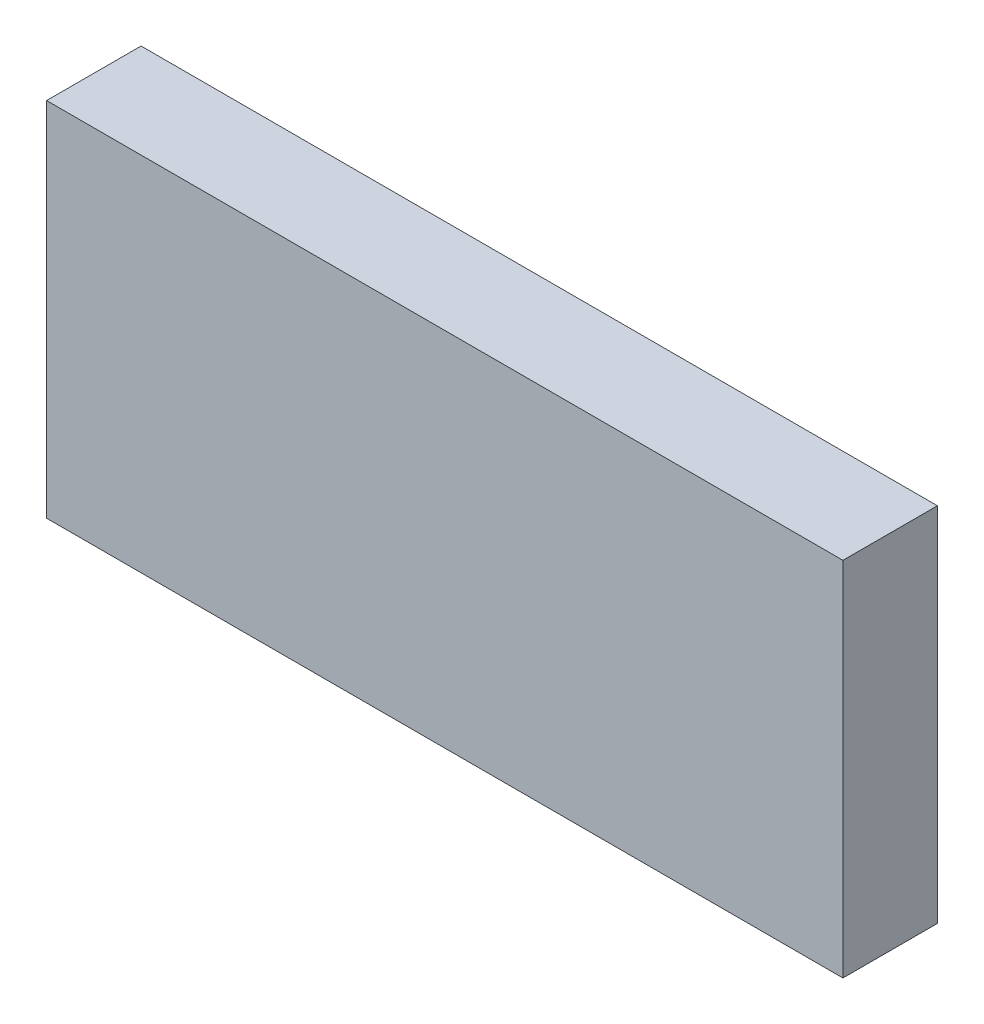
ISO-10303-21;
HEADER;
FILE_DESCRIPTION(('STEP AP214'),'2;1');
FILE_NAME('part.step','',(''),(''),'','','');
FILE_SCHEMA(('AUTOMOTIVE_DESIGN { 1 0 10303 214 1 1 1 1 }'));
ENDSEC;
DATA;
#1=APPLICATION_CONTEXT('core data for automotive mechanical design processes');
#2=APPLICATION_PROTOCOL_DEFINITION('international standard','automotive_design',2000,#1);
#3=PRODUCT_CONTEXT('',#1,'mechanical');
#4=PRODUCT('Part','Part','',(#3));
#5=PRODUCT_RELATED_PRODUCT_CATEGORY('part','',(#4));
#6=PRODUCT_DEFINITION_FORMATION('','',#4);
#7=PRODUCT_DEFINITION_CONTEXT('part definition',#1,'design');
#8=PRODUCT_DEFINITION('design','',#6,#7);
#9=PRODUCT_DEFINITION_SHAPE('','',#8);
#10=(LENGTH_UNIT() NAMED_UNIT(*) SI_UNIT(.MILLI.,.METRE.));
#11=(NAMED_UNIT(*) PLANE_ANGLE_UNIT() SI_UNIT($,.RADIAN.));
#12=(NAMED_UNIT(*) SI_UNIT($,.STERADIAN.) SOLID_ANGLE_UNIT());
#13=UNCERTAINTY_MEASURE_WITH_UNIT(LENGTH_MEASURE(1.E-05),#10,'distance_accuracy_value','');
#14=(GEOMETRIC_REPRESENTATION_CONTEXT(3) GLOBAL_UNCERTAINTY_ASSIGNED_CONTEXT((#13)) GLOBAL_UNIT_ASSIGNED_CONTEXT((#10,
#11,#12)) REPRESENTATION_CONTEXT('',''));
#15=CARTESIAN_POINT('',(0.,0.,0.));
#16=DIRECTION('',(0.,0.,1.));
#17=DIRECTION('',(1.,0.,0.));
#18=AXIS2_PLACEMENT_3D('',#15,#16,#17);
#19=CARTESIAN_POINT('',(0.,38.2926221353073,10.));
#20=DIRECTION('',(1.,0.,0.));
#21=DIRECTION('',(0.,0.,-1.));
#22=AXIS2_PLACEMENT_3D('',#19,#20,#21);
#23=PLANE('',#22);
#24=DIRECTION('',(0.,-1.,0.));
#25=VECTOR('',#24,1.);
#26=CARTESIAN_POINT('',(0.,38.2926221353073,0.));
#27=LINE('',#26,#25);
#28=CARTESIAN_POINT('',(0.,38.2926221353073,0.));
#29=VERTEX_POINT('',#28);
#30=CARTESIAN_POINT('',(0.,0.,0.));
#31=VERTEX_POINT('',#30);
#32=EDGE_CURVE('E113',#29,#31,#27,.T.);
#33=ORIENTED_EDGE('',*,*,#32,.T.);
#34=DIRECTION('',(0.,0.,-1.));
#35=VECTOR('',#34,1.);
#36=CARTESIAN_POINT('',(0.,0.,10.));
#37=LINE('',#36,#35);
#38=CARTESIAN_POINT('',(0.,0.,10.));
#39=VERTEX_POINT('',#38);
#40=EDGE_CURVE('E11',#39,#31,#37,.T.);
#41=ORIENTED_EDGE('',*,*,#40,.F.);
#42=DIRECTION('',(0.,-1.,0.));
#43=VECTOR('',#42,1.);
#44=CARTESIAN_POINT('',(0.,38.2926221353073,10.));
#45=LINE('',#44,#43);
#46=CARTESIAN_POINT('',(0.,38.2926221353073,10.));
#47=VERTEX_POINT('',#46);
#48=EDGE_CURVE('E97',#47,#39,#45,.T.);
#49=ORIENTED_EDGE('',*,*,#48,.F.);
#50=DIRECTION('',(0.,0.,-1.));
#51=VECTOR('',#50,1.);
#52=CARTESIAN_POINT('',(0.,38.2926221353073,10.));
#53=LINE('',#52,#51);
#54=EDGE_CURVE('E109',#47,#29,#53,.T.);
#55=ORIENTED_EDGE('',*,*,#54,.T.);
#56=EDGE_LOOP('',(#33,#41,#49,#55));
#57=FACE_BOUND('',#56,.T.);
#58=ADVANCED_FACE('F45',(#57),#23,.F.);
#59=CARTESIAN_POINT('',(0.,0.,10.));
#60=DIRECTION('',(0.,1.,0.));
#61=DIRECTION('',(0.,0.,1.));
#62=AXIS2_PLACEMENT_3D('',#59,#60,#61);
#63=PLANE('',#62);
#64=DIRECTION('',(1.,0.,0.));
#65=VECTOR('',#64,1.);
#66=CARTESIAN_POINT('',(0.,0.,0.));
#67=LINE('',#66,#65);
#68=CARTESIAN_POINT('',(84.2976702989358,0.,0.));
#69=VERTEX_POINT('',#68);
#70=EDGE_CURVE('E102',#31,#69,#67,.T.);
#71=ORIENTED_EDGE('',*,*,#70,.T.);
#72=DIRECTION('',(0.,0.,-1.));
#73=VECTOR('',#72,1.);
#74=CARTESIAN_POINT('',(84.2976702989358,0.,10.));
#75=LINE('',#74,#73);
#76=CARTESIAN_POINT('',(84.2976702989358,0.,10.));
#77=VERTEX_POINT('',#76);
#78=EDGE_CURVE('E54',#77,#69,#75,.T.);
#79=ORIENTED_EDGE('',*,*,#78,.F.);
#80=DIRECTION('',(1.,0.,0.));
#81=VECTOR('',#80,1.);
#82=CARTESIAN_POINT('',(0.,0.,10.));
#83=LINE('',#82,#81);
#84=EDGE_CURVE('E92',#39,#77,#83,.T.);
#85=ORIENTED_EDGE('',*,*,#84,.F.);
#86=ORIENTED_EDGE('',*,*,#40,.T.);
#87=EDGE_LOOP('',(#71,#79,#85,#86));
#88=FACE_BOUND('',#87,.T.);
#89=ADVANCED_FACE('F101',(#88),#63,.F.);
#90=CARTESIAN_POINT('',(84.2976702989358,0.,10.));
#91=DIRECTION('',(-1.,0.,0.));
#92=DIRECTION('',(0.,0.,1.));
#93=AXIS2_PLACEMENT_3D('',#90,#91,#92);
#94=PLANE('',#93);
#95=DIRECTION('',(0.,1.,0.));
#96=VECTOR('',#95,1.);
#97=CARTESIAN_POINT('',(84.2976702989358,0.,0.));
#98=LINE('',#97,#96);
#99=CARTESIAN_POINT('',(84.2976702989358,38.2926221353073,0.));
#100=VERTEX_POINT('',#99);
#101=EDGE_CURVE('E79',#69,#100,#98,.T.);
#102=ORIENTED_EDGE('',*,*,#101,.T.);
#103=DIRECTION('',(0.,0.,-1.));
#104=VECTOR('',#103,1.);
#105=CARTESIAN_POINT('',(84.2976702989358,38.2926221353073,10.));
#106=LINE('',#105,#104);
#107=CARTESIAN_POINT('',(84.2976702989358,38.2926221353073,10.));
#108=VERTEX_POINT('',#107);
#109=EDGE_CURVE('E104',#108,#100,#106,.T.);
#110=ORIENTED_EDGE('',*,*,#109,.F.);
#111=DIRECTION('',(0.,1.,0.));
#112=VECTOR('',#111,1.);
#113=CARTESIAN_POINT('',(84.2976702989358,0.,10.));
#114=LINE('',#113,#112);
#115=EDGE_CURVE('E95',#77,#108,#114,.T.);
#116=ORIENTED_EDGE('',*,*,#115,.F.);
#117=ORIENTED_EDGE('',*,*,#78,.T.);
#118=EDGE_LOOP('',(#102,#110,#116,#117));
#119=FACE_BOUND('',#118,.T.);
#120=ADVANCED_FACE('F105',(#119),#94,.F.);
#121=CARTESIAN_POINT('',(84.2976702989358,38.2926221353073,10.));
#122=DIRECTION('',(0.,-1.,0.));
#123=DIRECTION('',(0.,0.,-1.));
#124=AXIS2_PLACEMENT_3D('',#121,#122,#123);
#125=PLANE('',#124);
#126=DIRECTION('',(-1.,0.,0.));
#127=VECTOR('',#126,1.);
#128=CARTESIAN_POINT('',(84.2976702989358,38.2926221353073,0.));
#129=LINE('',#128,#127);
#130=EDGE_CURVE('E85',#100,#29,#129,.T.);
#131=ORIENTED_EDGE('',*,*,#130,.T.);
#132=ORIENTED_EDGE('',*,*,#54,.F.);
#133=DIRECTION('',(-1.,0.,0.));
#134=VECTOR('',#133,1.);
#135=CARTESIAN_POINT('',(84.2976702989358,38.2926221353073,10.));
#136=LINE('',#135,#134);
#137=EDGE_CURVE('E62',#108,#47,#136,.T.);
#138=ORIENTED_EDGE('',*,*,#137,.F.);
#139=ORIENTED_EDGE('',*,*,#109,.T.);
#140=EDGE_LOOP('',(#131,#132,#138,#139));
#141=FACE_BOUND('',#140,.T.);
#142=ADVANCED_FACE('F126',(#141),#125,.F.);
#143=CARTESIAN_POINT('',(0.,0.,10.));
#144=DIRECTION('',(0.,0.,1.));
#145=DIRECTION('',(1.,0.,0.));
#146=AXIS2_PLACEMENT_3D('',#143,#144,#145);
#147=PLANE('',#146);
#148=ORIENTED_EDGE('',*,*,#48,.T.);
#149=ORIENTED_EDGE('',*,*,#84,.T.);
#150=ORIENTED_EDGE('',*,*,#115,.T.);
#151=ORIENTED_EDGE('',*,*,#137,.T.);
#152=EDGE_LOOP('',(#148,#149,#150,#151));
#153=FACE_BOUND('',#152,.T.);
#154=ADVANCED_FACE('F93',(#153),#147,.T.);
#155=CARTESIAN_POINT('',(0.,0.,0.));
#156=DIRECTION('',(0.,0.,1.));
#157=DIRECTION('',(1.,0.,0.));
#158=AXIS2_PLACEMENT_3D('',#155,#156,#157);
#159=PLANE('',#158);
#160=ORIENTED_EDGE('',*,*,#32,.F.);
#161=ORIENTED_EDGE('',*,*,#130,.F.);
#162=ORIENTED_EDGE('',*,*,#101,.F.);
#163=ORIENTED_EDGE('',*,*,#70,.F.);
#164=EDGE_LOOP('',(#160,#161,#162,#163));
#165=FACE_BOUND('',#164,.T.);
#166=ADVANCED_FACE('F129',(#165),#159,.F.);
#167=CLOSED_SHELL('',(#58,#89,#120,#142,#154,#166));
#168=MANIFOLD_SOLID_BREP('B2',#167);
#169=ADVANCED_BREP_SHAPE_REPRESENTATION('',(#18,#168),#14);
#170=SHAPE_DEFINITION_REPRESENTATION(#9,#169);
ENDSEC;
END-ISO-10303-21;
